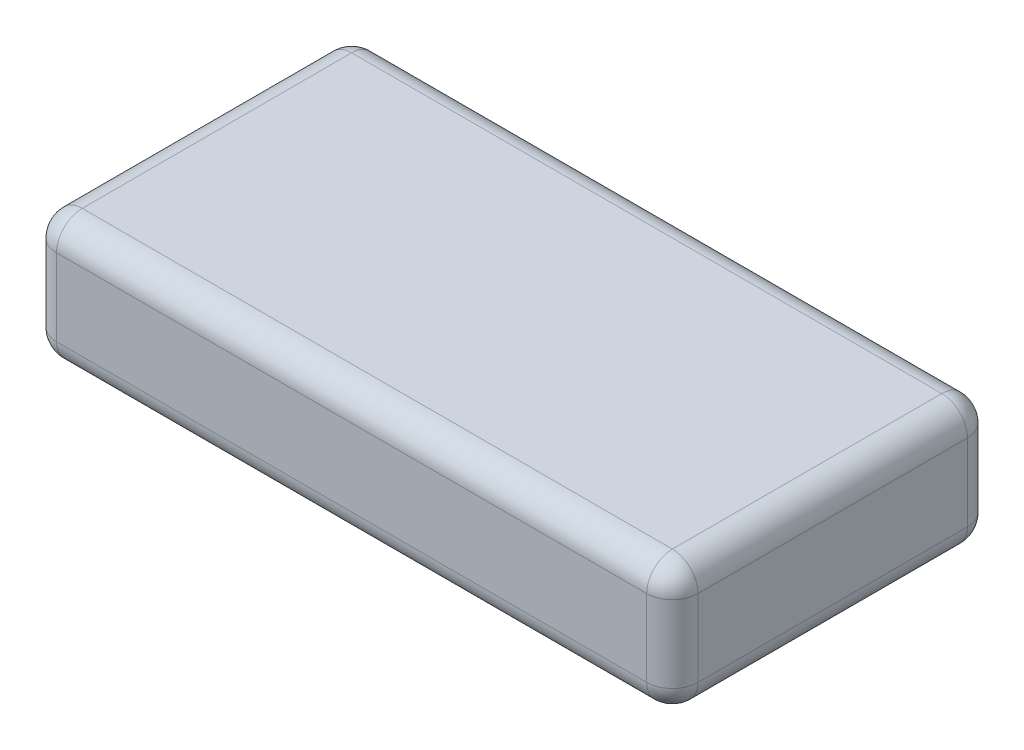
ISO-10303-21;
HEADER;
FILE_DESCRIPTION(('STEP AP214'),'2;1');
FILE_NAME('part.step','',(''),(''),'','','');
FILE_SCHEMA(('AUTOMOTIVE_DESIGN { 1 0 10303 214 1 1 1 1 }'));
ENDSEC;
DATA;
#1=APPLICATION_CONTEXT('core data for automotive mechanical design processes');
#2=APPLICATION_PROTOCOL_DEFINITION('international standard','automotive_design',2000,#1);
#3=PRODUCT_CONTEXT('',#1,'mechanical');
#4=PRODUCT('Part','Part','',(#3));
#5=PRODUCT_RELATED_PRODUCT_CATEGORY('part','',(#4));
#6=PRODUCT_DEFINITION_FORMATION('','',#4);
#7=PRODUCT_DEFINITION_CONTEXT('part definition',#1,'design');
#8=PRODUCT_DEFINITION('design','',#6,#7);
#9=PRODUCT_DEFINITION_SHAPE('','',#8);
#10=(LENGTH_UNIT() NAMED_UNIT(*) SI_UNIT(.MILLI.,.METRE.));
#11=(NAMED_UNIT(*) PLANE_ANGLE_UNIT() SI_UNIT($,.RADIAN.));
#12=(NAMED_UNIT(*) SI_UNIT($,.STERADIAN.) SOLID_ANGLE_UNIT());
#13=UNCERTAINTY_MEASURE_WITH_UNIT(LENGTH_MEASURE(1.E-05),#10,'distance_accuracy_value','');
#14=(GEOMETRIC_REPRESENTATION_CONTEXT(3) GLOBAL_UNCERTAINTY_ASSIGNED_CONTEXT((#13)) GLOBAL_UNIT_ASSIGNED_CONTEXT((#10,
#11,#12)) REPRESENTATION_CONTEXT('',''));
#15=CARTESIAN_POINT('',(0.,0.,0.));
#16=DIRECTION('',(0.,0.,1.));
#17=DIRECTION('',(1.,0.,0.));
#18=AXIS2_PLACEMENT_3D('',#15,#16,#17);
#19=CARTESIAN_POINT('',(0.,2.,0.));
#20=DIRECTION('',(1.,0.,0.));
#21=DIRECTION('',(0.,0.,-1.));
#22=AXIS2_PLACEMENT_3D('',#19,#20,#21);
#23=PLANE('',#22);
#24=DIRECTION('',(0.,0.,1.));
#25=VECTOR('',#24,1.);
#26=CARTESIAN_POINT('',(0.,1.6,0.));
#27=LINE('',#26,#25);
#28=CARTESIAN_POINT('',(0.,1.6,4.6));
#29=VERTEX_POINT('',#28);
#30=CARTESIAN_POINT('',(0.,1.6,0.4));
#31=VERTEX_POINT('',#30);
#32=EDGE_CURVE('E159',#29,#31,#27,.F.);
#33=ORIENTED_EDGE('',*,*,#32,.T.);
#34=DIRECTION('',(0.,-1.,0.));
#35=VECTOR('',#34,1.);
#36=CARTESIAN_POINT('',(0.,2.,0.4));
#37=LINE('',#36,#35);
#38=CARTESIAN_POINT('',(0.,0.4,0.4));
#39=VERTEX_POINT('',#38);
#40=EDGE_CURVE('E132',#31,#39,#37,.T.);
#41=ORIENTED_EDGE('',*,*,#40,.T.);
#42=DIRECTION('',(0.,0.,1.));
#43=VECTOR('',#42,1.);
#44=CARTESIAN_POINT('',(0.,0.4,0.));
#45=LINE('',#44,#43);
#46=CARTESIAN_POINT('',(0.,0.4,4.6));
#47=VERTEX_POINT('',#46);
#48=EDGE_CURVE('E150',#39,#47,#45,.T.);
#49=ORIENTED_EDGE('',*,*,#48,.T.);
#50=DIRECTION('',(0.,-1.,0.));
#51=VECTOR('',#50,1.);
#52=CARTESIAN_POINT('',(0.,2.,4.6));
#53=LINE('',#52,#51);
#54=EDGE_CURVE('E156',#47,#29,#53,.F.);
#55=ORIENTED_EDGE('',*,*,#54,.T.);
#56=EDGE_LOOP('',(#33,#41,#49,#55));
#57=FACE_BOUND('',#56,.T.);
#58=ADVANCED_FACE('F38',(#57),#23,.F.);
#59=CARTESIAN_POINT('',(0.,2.,5.));
#60=DIRECTION('',(0.,0.,-1.));
#61=DIRECTION('',(-1.,0.,0.));
#62=AXIS2_PLACEMENT_3D('',#59,#60,#61);
#63=PLANE('',#62);
#64=DIRECTION('',(0.,-1.,0.));
#65=VECTOR('',#64,1.);
#66=CARTESIAN_POINT('',(0.400000000000001,2.,5.));
#67=LINE('',#66,#65);
#68=CARTESIAN_POINT('',(0.400000000000001,1.6,5.));
#69=VERTEX_POINT('',#68);
#70=CARTESIAN_POINT('',(0.400000000000001,0.4,5.));
#71=VERTEX_POINT('',#70);
#72=EDGE_CURVE('E185',#69,#71,#67,.T.);
#73=ORIENTED_EDGE('',*,*,#72,.T.);
#74=DIRECTION('',(1.,0.,0.));
#75=VECTOR('',#74,1.);
#76=CARTESIAN_POINT('',(0.,0.4,5.));
#77=LINE('',#76,#75);
#78=CARTESIAN_POINT('',(9.6,0.4,5.));
#79=VERTEX_POINT('',#78);
#80=EDGE_CURVE('E188',#71,#79,#77,.T.);
#81=ORIENTED_EDGE('',*,*,#80,.T.);
#82=DIRECTION('',(0.,-1.,0.));
#83=VECTOR('',#82,1.);
#84=CARTESIAN_POINT('',(9.6,2.,5.));
#85=LINE('',#84,#83);
#86=CARTESIAN_POINT('',(9.6,1.6,5.));
#87=VERTEX_POINT('',#86);
#88=EDGE_CURVE('E183',#79,#87,#85,.F.);
#89=ORIENTED_EDGE('',*,*,#88,.T.);
#90=DIRECTION('',(1.,0.,0.));
#91=VECTOR('',#90,1.);
#92=CARTESIAN_POINT('',(0.,1.6,5.));
#93=LINE('',#92,#91);
#94=EDGE_CURVE('E181',#87,#69,#93,.F.);
#95=ORIENTED_EDGE('',*,*,#94,.T.);
#96=EDGE_LOOP('',(#73,#81,#89,#95));
#97=FACE_BOUND('',#96,.T.);
#98=ADVANCED_FACE('F285',(#97),#63,.F.);
#99=CARTESIAN_POINT('',(9.99999999999999,2.,0.));
#100=DIRECTION('',(-1.,0.,0.));
#101=DIRECTION('',(0.,0.,1.));
#102=AXIS2_PLACEMENT_3D('',#99,#100,#101);
#103=PLANE('',#102);
#104=DIRECTION('',(0.,-1.,0.));
#105=VECTOR('',#104,1.);
#106=CARTESIAN_POINT('',(10.,2.,4.6));
#107=LINE('',#106,#105);
#108=CARTESIAN_POINT('',(10.,1.6,4.6));
#109=VERTEX_POINT('',#108);
#110=CARTESIAN_POINT('',(10.,0.4,4.6));
#111=VERTEX_POINT('',#110);
#112=EDGE_CURVE('E47',#109,#111,#107,.T.);
#113=ORIENTED_EDGE('',*,*,#112,.T.);
#114=DIRECTION('',(0.,0.,-1.));
#115=VECTOR('',#114,1.);
#116=CARTESIAN_POINT('',(9.99999999999999,0.4,0.));
#117=LINE('',#116,#115);
#118=CARTESIAN_POINT('',(9.99999999999999,0.4,0.4));
#119=VERTEX_POINT('',#118);
#120=EDGE_CURVE('E11',#111,#119,#117,.T.);
#121=ORIENTED_EDGE('',*,*,#120,.T.);
#122=DIRECTION('',(0.,-1.,0.));
#123=VECTOR('',#122,1.);
#124=CARTESIAN_POINT('',(9.99999999999999,2.,0.4));
#125=LINE('',#124,#123);
#126=CARTESIAN_POINT('',(9.99999999999999,1.6,0.4));
#127=VERTEX_POINT('',#126);
#128=EDGE_CURVE('E201',#119,#127,#125,.F.);
#129=ORIENTED_EDGE('',*,*,#128,.T.);
#130=DIRECTION('',(0.,0.,-1.));
#131=VECTOR('',#130,1.);
#132=CARTESIAN_POINT('',(10.,1.6,5.));
#133=LINE('',#132,#131);
#134=EDGE_CURVE('E199',#127,#109,#133,.F.);
#135=ORIENTED_EDGE('',*,*,#134,.T.);
#136=EDGE_LOOP('',(#113,#121,#129,#135));
#137=FACE_BOUND('',#136,.T.);
#138=ADVANCED_FACE('F297',(#137),#103,.F.);
#139=CARTESIAN_POINT('',(0.,2.,0.));
#140=DIRECTION('',(0.,0.,1.));
#141=DIRECTION('',(1.,0.,0.));
#142=AXIS2_PLACEMENT_3D('',#139,#140,#141);
#143=PLANE('',#142);
#144=DIRECTION('',(0.,-1.,0.));
#145=VECTOR('',#144,1.);
#146=CARTESIAN_POINT('',(9.6,2.,0.));
#147=LINE('',#146,#145);
#148=CARTESIAN_POINT('',(9.6,1.6,0.));
#149=VERTEX_POINT('',#148);
#150=CARTESIAN_POINT('',(9.6,0.4,0.));
#151=VERTEX_POINT('',#150);
#152=EDGE_CURVE('E163',#149,#151,#147,.T.);
#153=ORIENTED_EDGE('',*,*,#152,.T.);
#154=DIRECTION('',(-1.,0.,0.));
#155=VECTOR('',#154,1.);
#156=CARTESIAN_POINT('',(0.,0.4,0.));
#157=LINE('',#156,#155);
#158=CARTESIAN_POINT('',(0.4,0.4,0.));
#159=VERTEX_POINT('',#158);
#160=EDGE_CURVE('E170',#151,#159,#157,.T.);
#161=ORIENTED_EDGE('',*,*,#160,.T.);
#162=DIRECTION('',(0.,-1.,0.));
#163=VECTOR('',#162,1.);
#164=CARTESIAN_POINT('',(0.4,2.,0.));
#165=LINE('',#164,#163);
#166=CARTESIAN_POINT('',(0.4,1.6,0.));
#167=VERTEX_POINT('',#166);
#168=EDGE_CURVE('E134',#159,#167,#165,.F.);
#169=ORIENTED_EDGE('',*,*,#168,.T.);
#170=DIRECTION('',(-1.,0.,0.));
#171=VECTOR('',#170,1.);
#172=CARTESIAN_POINT('',(9.99999999999999,1.6,0.));
#173=LINE('',#172,#171);
#174=EDGE_CURVE('E161',#167,#149,#173,.F.);
#175=ORIENTED_EDGE('',*,*,#174,.T.);
#176=EDGE_LOOP('',(#153,#161,#169,#175));
#177=FACE_BOUND('',#176,.T.);
#178=ADVANCED_FACE('F311',(#177),#143,.F.);
#179=CARTESIAN_POINT('',(0.,2.,0.));
#180=DIRECTION('',(0.,1.,0.));
#181=DIRECTION('',(0.,0.,1.));
#182=AXIS2_PLACEMENT_3D('',#179,#180,#181);
#183=PLANE('',#182);
#184=DIRECTION('',(0.,0.,-1.));
#185=VECTOR('',#184,1.);
#186=CARTESIAN_POINT('',(9.6,2.,0.));
#187=LINE('',#186,#185);
#188=CARTESIAN_POINT('',(9.6,2.,4.6));
#189=VERTEX_POINT('',#188);
#190=CARTESIAN_POINT('',(9.6,2.,0.4));
#191=VERTEX_POINT('',#190);
#192=EDGE_CURVE('E174',#189,#191,#187,.T.);
#193=ORIENTED_EDGE('',*,*,#192,.T.);
#194=DIRECTION('',(-1.,0.,0.));
#195=VECTOR('',#194,1.);
#196=CARTESIAN_POINT('',(0.,2.,0.4));
#197=LINE('',#196,#195);
#198=CARTESIAN_POINT('',(0.4,2.,0.4));
#199=VERTEX_POINT('',#198);
#200=EDGE_CURVE('E179',#191,#199,#197,.T.);
#201=ORIENTED_EDGE('',*,*,#200,.T.);
#202=DIRECTION('',(0.,0.,1.));
#203=VECTOR('',#202,1.);
#204=CARTESIAN_POINT('',(0.400000000000001,2.,5.));
#205=LINE('',#204,#203);
#206=CARTESIAN_POINT('',(0.400000000000001,2.,4.6));
#207=VERTEX_POINT('',#206);
#208=EDGE_CURVE('E176',#199,#207,#205,.T.);
#209=ORIENTED_EDGE('',*,*,#208,.T.);
#210=DIRECTION('',(1.,0.,0.));
#211=VECTOR('',#210,1.);
#212=CARTESIAN_POINT('',(10.,2.,4.6));
#213=LINE('',#212,#211);
#214=EDGE_CURVE('E172',#207,#189,#213,.T.);
#215=ORIENTED_EDGE('',*,*,#214,.T.);
#216=EDGE_LOOP('',(#193,#201,#209,#215));
#217=FACE_BOUND('',#216,.T.);
#218=ADVANCED_FACE('F276',(#217),#183,.T.);
#219=CARTESIAN_POINT('',(0.,0.,0.));
#220=DIRECTION('',(0.,1.,0.));
#221=DIRECTION('',(0.,0.,1.));
#222=AXIS2_PLACEMENT_3D('',#219,#220,#221);
#223=PLANE('',#222);
#224=DIRECTION('',(1.,0.,0.));
#225=VECTOR('',#224,1.);
#226=CARTESIAN_POINT('',(0.,0.,4.6));
#227=LINE('',#226,#225);
#228=CARTESIAN_POINT('',(9.6,0.,4.6));
#229=VERTEX_POINT('',#228);
#230=CARTESIAN_POINT('',(0.400000000000001,0.,4.6));
#231=VERTEX_POINT('',#230);
#232=EDGE_CURVE('E192',#229,#231,#227,.F.);
#233=ORIENTED_EDGE('',*,*,#232,.T.);
#234=DIRECTION('',(0.,0.,1.));
#235=VECTOR('',#234,1.);
#236=CARTESIAN_POINT('',(0.4,0.,0.));
#237=LINE('',#236,#235);
#238=CARTESIAN_POINT('',(0.4,0.,0.4));
#239=VERTEX_POINT('',#238);
#240=EDGE_CURVE('E196',#231,#239,#237,.F.);
#241=ORIENTED_EDGE('',*,*,#240,.T.);
#242=DIRECTION('',(-1.,0.,0.));
#243=VECTOR('',#242,1.);
#244=CARTESIAN_POINT('',(0.,0.,0.4));
#245=LINE('',#244,#243);
#246=CARTESIAN_POINT('',(9.6,0.,0.4));
#247=VERTEX_POINT('',#246);
#248=EDGE_CURVE('E194',#239,#247,#245,.F.);
#249=ORIENTED_EDGE('',*,*,#248,.T.);
#250=DIRECTION('',(0.,0.,-1.));
#251=VECTOR('',#250,1.);
#252=CARTESIAN_POINT('',(9.6,0.,0.));
#253=LINE('',#252,#251);
#254=EDGE_CURVE('E190',#247,#229,#253,.F.);
#255=ORIENTED_EDGE('',*,*,#254,.T.);
#256=EDGE_LOOP('',(#233,#241,#249,#255));
#257=FACE_BOUND('',#256,.T.);
#258=ADVANCED_FACE('F482',(#257),#223,.F.);
#259=CARTESIAN_POINT('',(9.6,2.,4.6));
#260=DIRECTION('',(0.,-1.,0.));
#261=DIRECTION('',(0.,0.,-1.));
#262=AXIS2_PLACEMENT_3D('',#259,#260,#261);
#263=CYLINDRICAL_SURFACE('',#262,0.4);
#264=CARTESIAN_POINT('',(9.6,1.6,4.6));
#265=DIRECTION('',(0.,1.,0.));
#266=DIRECTION('',(0.,0.,1.));
#267=AXIS2_PLACEMENT_3D('',#264,#265,#266);
#268=CIRCLE('',#267,0.4);
#269=EDGE_CURVE('E42',#87,#109,#268,.T.);
#270=ORIENTED_EDGE('',*,*,#269,.F.);
#271=ORIENTED_EDGE('',*,*,#88,.F.);
#272=CARTESIAN_POINT('',(9.6,0.4,4.6));
#273=DIRECTION('',(0.,-1.,0.));
#274=DIRECTION('',(0.,0.,-1.));
#275=AXIS2_PLACEMENT_3D('',#272,#273,#274);
#276=CIRCLE('',#275,0.4);
#277=EDGE_CURVE('E253',#111,#79,#276,.T.);
#278=ORIENTED_EDGE('',*,*,#277,.F.);
#279=ORIENTED_EDGE('',*,*,#112,.F.);
#280=EDGE_LOOP('',(#270,#271,#278,#279));
#281=FACE_BOUND('',#280,.T.);
#282=ADVANCED_FACE('F40',(#281),#263,.T.);
#283=CARTESIAN_POINT('',(9.6,1.6,4.6));
#284=DIRECTION('',(0.,0.,1.));
#285=DIRECTION('',(1.,0.,0.));
#286=AXIS2_PLACEMENT_3D('',#283,#284,#285);
#287=SPHERICAL_SURFACE('',#286,0.4);
#288=CARTESIAN_POINT('',(9.6,1.6,4.6));
#289=DIRECTION('',(1.,0.,0.));
#290=DIRECTION('',(0.,0.,-1.));
#291=AXIS2_PLACEMENT_3D('',#288,#289,#290);
#292=CIRCLE('',#291,0.4);
#293=EDGE_CURVE('E248',#87,#189,#292,.F.);
#294=ORIENTED_EDGE('',*,*,#293,.F.);
#295=ORIENTED_EDGE('',*,*,#269,.T.);
#296=CARTESIAN_POINT('',(9.6,1.6,4.6));
#297=DIRECTION('',(0.,0.,1.));
#298=DIRECTION('',(1.,0.,0.));
#299=AXIS2_PLACEMENT_3D('',#296,#297,#298);
#300=CIRCLE('',#299,0.4);
#301=EDGE_CURVE('E251',#189,#109,#300,.F.);
#302=ORIENTED_EDGE('',*,*,#301,.F.);
#303=EDGE_LOOP('',(#294,#295,#302));
#304=FACE_BOUND('',#303,.T.);
#305=ADVANCED_FACE('F263',(#304),#287,.T.);
#306=CARTESIAN_POINT('',(9.6,0.4,4.6));
#307=DIRECTION('',(0.,0.,1.));
#308=DIRECTION('',(1.,0.,0.));
#309=AXIS2_PLACEMENT_3D('',#306,#307,#308);
#310=SPHERICAL_SURFACE('',#309,0.4);
#311=CARTESIAN_POINT('',(9.6,0.4,4.6));
#312=DIRECTION('',(0.,0.,1.));
#313=DIRECTION('',(1.,0.,0.));
#314=AXIS2_PLACEMENT_3D('',#311,#312,#313);
#315=CIRCLE('',#314,0.4);
#316=EDGE_CURVE('E243',#111,#229,#315,.F.);
#317=ORIENTED_EDGE('',*,*,#316,.F.);
#318=ORIENTED_EDGE('',*,*,#277,.T.);
#319=CARTESIAN_POINT('',(9.6,0.4,4.6));
#320=DIRECTION('',(1.,0.,0.));
#321=DIRECTION('',(0.,0.,-1.));
#322=AXIS2_PLACEMENT_3D('',#319,#320,#321);
#323=CIRCLE('',#322,0.4);
#324=EDGE_CURVE('E245',#229,#79,#323,.F.);
#325=ORIENTED_EDGE('',*,*,#324,.F.);
#326=EDGE_LOOP('',(#317,#318,#325));
#327=FACE_BOUND('',#326,.T.);
#328=ADVANCED_FACE('F461',(#327),#310,.T.);
#329=CARTESIAN_POINT('',(9.6,1.6,0.));
#330=DIRECTION('',(0.,0.,1.));
#331=DIRECTION('',(1.,0.,0.));
#332=AXIS2_PLACEMENT_3D('',#329,#330,#331);
#333=CYLINDRICAL_SURFACE('',#332,0.4);
#334=ORIENTED_EDGE('',*,*,#301,.T.);
#335=ORIENTED_EDGE('',*,*,#134,.F.);
#336=CARTESIAN_POINT('',(9.6,1.6,0.4));
#337=DIRECTION('',(0.,0.,-1.));
#338=DIRECTION('',(-1.,0.,0.));
#339=AXIS2_PLACEMENT_3D('',#336,#337,#338);
#340=CIRCLE('',#339,0.4);
#341=EDGE_CURVE('E237',#191,#127,#340,.T.);
#342=ORIENTED_EDGE('',*,*,#341,.F.);
#343=ORIENTED_EDGE('',*,*,#192,.F.);
#344=EDGE_LOOP('',(#334,#335,#342,#343));
#345=FACE_BOUND('',#344,.T.);
#346=ADVANCED_FACE('F271',(#345),#333,.T.);
#347=CARTESIAN_POINT('',(0.,1.6,4.6));
#348=DIRECTION('',(-1.,0.,0.));
#349=DIRECTION('',(0.,0.,1.));
#350=AXIS2_PLACEMENT_3D('',#347,#348,#349);
#351=CYLINDRICAL_SURFACE('',#350,0.4);
#352=ORIENTED_EDGE('',*,*,#293,.T.);
#353=ORIENTED_EDGE('',*,*,#214,.F.);
#354=CARTESIAN_POINT('',(0.400000000000001,1.6,4.6));
#355=DIRECTION('',(-1.,0.,0.));
#356=DIRECTION('',(0.,0.,1.));
#357=AXIS2_PLACEMENT_3D('',#354,#355,#356);
#358=CIRCLE('',#357,0.4);
#359=EDGE_CURVE('E234',#69,#207,#358,.T.);
#360=ORIENTED_EDGE('',*,*,#359,.F.);
#361=ORIENTED_EDGE('',*,*,#94,.F.);
#362=EDGE_LOOP('',(#352,#353,#360,#361));
#363=FACE_BOUND('',#362,.T.);
#364=ADVANCED_FACE('F282',(#363),#351,.T.);
#365=CARTESIAN_POINT('',(0.400000000000001,2.,4.6));
#366=DIRECTION('',(0.,-1.,0.));
#367=DIRECTION('',(0.,0.,-1.));
#368=AXIS2_PLACEMENT_3D('',#365,#366,#367);
#369=CYLINDRICAL_SURFACE('',#368,0.4);
#370=CARTESIAN_POINT('',(0.400000000000001,0.4,4.6));
#371=DIRECTION('',(0.,-1.,0.));
#372=DIRECTION('',(0.,0.,-1.));
#373=AXIS2_PLACEMENT_3D('',#370,#371,#372);
#374=CIRCLE('',#373,0.4);
#375=EDGE_CURVE('E228',#71,#47,#374,.T.);
#376=ORIENTED_EDGE('',*,*,#375,.F.);
#377=ORIENTED_EDGE('',*,*,#72,.F.);
#378=CARTESIAN_POINT('',(0.400000000000001,1.6,4.6));
#379=DIRECTION('',(0.,1.,0.));
#380=DIRECTION('',(0.,0.,1.));
#381=AXIS2_PLACEMENT_3D('',#378,#379,#380);
#382=CIRCLE('',#381,0.4);
#383=EDGE_CURVE('E231',#29,#69,#382,.T.);
#384=ORIENTED_EDGE('',*,*,#383,.F.);
#385=ORIENTED_EDGE('',*,*,#54,.F.);
#386=EDGE_LOOP('',(#376,#377,#384,#385));
#387=FACE_BOUND('',#386,.T.);
#388=ADVANCED_FACE('F289',(#387),#369,.T.);
#389=CARTESIAN_POINT('',(0.,0.4,4.6));
#390=DIRECTION('',(1.,0.,0.));
#391=DIRECTION('',(0.,0.,-1.));
#392=AXIS2_PLACEMENT_3D('',#389,#390,#391);
#393=CYLINDRICAL_SURFACE('',#392,0.4);
#394=ORIENTED_EDGE('',*,*,#324,.T.);
#395=ORIENTED_EDGE('',*,*,#80,.F.);
#396=CARTESIAN_POINT('',(0.400000000000001,0.4,4.6));
#397=DIRECTION('',(-1.,0.,0.));
#398=DIRECTION('',(0.,0.,1.));
#399=AXIS2_PLACEMENT_3D('',#396,#397,#398);
#400=CIRCLE('',#399,0.4);
#401=EDGE_CURVE('E226',#231,#71,#400,.T.);
#402=ORIENTED_EDGE('',*,*,#401,.F.);
#403=ORIENTED_EDGE('',*,*,#232,.F.);
#404=EDGE_LOOP('',(#394,#395,#402,#403));
#405=FACE_BOUND('',#404,.T.);
#406=ADVANCED_FACE('F295',(#405),#393,.T.);
#407=CARTESIAN_POINT('',(9.6,0.4,0.));
#408=DIRECTION('',(0.,0.,-1.));
#409=DIRECTION('',(-1.,0.,0.));
#410=AXIS2_PLACEMENT_3D('',#407,#408,#409);
#411=CYLINDRICAL_SURFACE('',#410,0.4);
#412=ORIENTED_EDGE('',*,*,#316,.T.);
#413=ORIENTED_EDGE('',*,*,#254,.F.);
#414=CARTESIAN_POINT('',(9.6,0.4,0.4));
#415=DIRECTION('',(0.,0.,-1.));
#416=DIRECTION('',(-1.,0.,0.));
#417=AXIS2_PLACEMENT_3D('',#414,#415,#416);
#418=CIRCLE('',#417,0.4);
#419=EDGE_CURVE('E223',#119,#247,#418,.T.);
#420=ORIENTED_EDGE('',*,*,#419,.F.);
#421=ORIENTED_EDGE('',*,*,#120,.F.);
#422=EDGE_LOOP('',(#412,#413,#420,#421));
#423=FACE_BOUND('',#422,.T.);
#424=ADVANCED_FACE('F304',(#423),#411,.T.);
#425=CARTESIAN_POINT('',(9.6,2.,0.4));
#426=DIRECTION('',(0.,-1.,0.));
#427=DIRECTION('',(0.,0.,-1.));
#428=AXIS2_PLACEMENT_3D('',#425,#426,#427);
#429=CYLINDRICAL_SURFACE('',#428,0.4);
#430=CARTESIAN_POINT('',(9.6,1.6,0.4));
#431=DIRECTION('',(0.,1.,0.));
#432=DIRECTION('',(0.,0.,1.));
#433=AXIS2_PLACEMENT_3D('',#430,#431,#432);
#434=CIRCLE('',#433,0.4);
#435=EDGE_CURVE('E240',#127,#149,#434,.T.);
#436=ORIENTED_EDGE('',*,*,#435,.F.);
#437=ORIENTED_EDGE('',*,*,#128,.F.);
#438=CARTESIAN_POINT('',(9.6,0.4,0.4));
#439=DIRECTION('',(0.,-1.,0.));
#440=DIRECTION('',(0.,0.,-1.));
#441=AXIS2_PLACEMENT_3D('',#438,#439,#440);
#442=CIRCLE('',#441,0.4);
#443=EDGE_CURVE('E220',#151,#119,#442,.T.);
#444=ORIENTED_EDGE('',*,*,#443,.F.);
#445=ORIENTED_EDGE('',*,*,#152,.F.);
#446=EDGE_LOOP('',(#436,#437,#444,#445));
#447=FACE_BOUND('',#446,.T.);
#448=ADVANCED_FACE('F300',(#447),#429,.T.);
#449=CARTESIAN_POINT('',(9.6,1.6,0.4));
#450=DIRECTION('',(0.,0.,1.));
#451=DIRECTION('',(1.,0.,0.));
#452=AXIS2_PLACEMENT_3D('',#449,#450,#451);
#453=SPHERICAL_SURFACE('',#452,0.4);
#454=ORIENTED_EDGE('',*,*,#341,.T.);
#455=ORIENTED_EDGE('',*,*,#435,.T.);
#456=CARTESIAN_POINT('',(9.6,1.6,0.4));
#457=DIRECTION('',(1.,0.,0.));
#458=DIRECTION('',(0.,0.,-1.));
#459=AXIS2_PLACEMENT_3D('',#456,#457,#458);
#460=CIRCLE('',#459,0.4);
#461=EDGE_CURVE('E217',#191,#149,#460,.F.);
#462=ORIENTED_EDGE('',*,*,#461,.F.);
#463=EDGE_LOOP('',(#454,#455,#462));
#464=FACE_BOUND('',#463,.T.);
#465=ADVANCED_FACE('F314',(#464),#453,.T.);
#466=CARTESIAN_POINT('',(0.400000000000001,1.6,4.6));
#467=DIRECTION('',(0.,0.,1.));
#468=DIRECTION('',(1.,0.,0.));
#469=AXIS2_PLACEMENT_3D('',#466,#467,#468);
#470=SPHERICAL_SURFACE('',#469,0.4);
#471=ORIENTED_EDGE('',*,*,#383,.T.);
#472=ORIENTED_EDGE('',*,*,#359,.T.);
#473=CARTESIAN_POINT('',(0.400000000000001,1.6,4.6));
#474=DIRECTION('',(0.,0.,1.));
#475=DIRECTION('',(1.,0.,0.));
#476=AXIS2_PLACEMENT_3D('',#473,#474,#475);
#477=CIRCLE('',#476,0.4);
#478=EDGE_CURVE('E215',#29,#207,#477,.F.);
#479=ORIENTED_EDGE('',*,*,#478,.F.);
#480=EDGE_LOOP('',(#471,#472,#479));
#481=FACE_BOUND('',#480,.T.);
#482=ADVANCED_FACE('F324',(#481),#470,.T.);
#483=CARTESIAN_POINT('',(0.400000000000001,0.4,4.6));
#484=DIRECTION('',(0.,0.,1.));
#485=DIRECTION('',(1.,0.,0.));
#486=AXIS2_PLACEMENT_3D('',#483,#484,#485);
#487=SPHERICAL_SURFACE('',#486,0.4);
#488=ORIENTED_EDGE('',*,*,#401,.T.);
#489=ORIENTED_EDGE('',*,*,#375,.T.);
#490=CARTESIAN_POINT('',(0.400000000000001,0.4,4.6));
#491=DIRECTION('',(0.,0.,1.));
#492=DIRECTION('',(1.,0.,0.));
#493=AXIS2_PLACEMENT_3D('',#490,#491,#492);
#494=CIRCLE('',#493,0.4);
#495=EDGE_CURVE('E153',#231,#47,#494,.F.);
#496=ORIENTED_EDGE('',*,*,#495,.F.);
#497=EDGE_LOOP('',(#488,#489,#496));
#498=FACE_BOUND('',#497,.T.);
#499=ADVANCED_FACE('F326',(#498),#487,.T.);
#500=CARTESIAN_POINT('',(9.6,0.4,0.4));
#501=DIRECTION('',(0.,0.,1.));
#502=DIRECTION('',(1.,0.,0.));
#503=AXIS2_PLACEMENT_3D('',#500,#501,#502);
#504=SPHERICAL_SURFACE('',#503,0.4);
#505=ORIENTED_EDGE('',*,*,#443,.T.);
#506=ORIENTED_EDGE('',*,*,#419,.T.);
#507=CARTESIAN_POINT('',(9.6,0.4,0.4));
#508=DIRECTION('',(1.,0.,0.));
#509=DIRECTION('',(0.,0.,-1.));
#510=AXIS2_PLACEMENT_3D('',#507,#508,#509);
#511=CIRCLE('',#510,0.4);
#512=EDGE_CURVE('E211',#151,#247,#511,.F.);
#513=ORIENTED_EDGE('',*,*,#512,.F.);
#514=EDGE_LOOP('',(#505,#506,#513));
#515=FACE_BOUND('',#514,.T.);
#516=ADVANCED_FACE('F306',(#515),#504,.T.);
#517=CARTESIAN_POINT('',(0.,1.6,0.4));
#518=DIRECTION('',(1.,0.,0.));
#519=DIRECTION('',(0.,0.,-1.));
#520=AXIS2_PLACEMENT_3D('',#517,#518,#519);
#521=CYLINDRICAL_SURFACE('',#520,0.4);
#522=ORIENTED_EDGE('',*,*,#461,.T.);
#523=ORIENTED_EDGE('',*,*,#174,.F.);
#524=CARTESIAN_POINT('',(0.4,1.6,0.4));
#525=DIRECTION('',(-1.,0.,0.));
#526=DIRECTION('',(0.,0.,1.));
#527=AXIS2_PLACEMENT_3D('',#524,#525,#526);
#528=CIRCLE('',#527,0.4);
#529=EDGE_CURVE('E208',#199,#167,#528,.T.);
#530=ORIENTED_EDGE('',*,*,#529,.F.);
#531=ORIENTED_EDGE('',*,*,#200,.F.);
#532=EDGE_LOOP('',(#522,#523,#530,#531));
#533=FACE_BOUND('',#532,.T.);
#534=ADVANCED_FACE('F316',(#533),#521,.T.);
#535=CARTESIAN_POINT('',(0.4,1.6,0.));
#536=DIRECTION('',(0.,0.,-1.));
#537=DIRECTION('',(-1.,0.,0.));
#538=AXIS2_PLACEMENT_3D('',#535,#536,#537);
#539=CYLINDRICAL_SURFACE('',#538,0.4);
#540=ORIENTED_EDGE('',*,*,#478,.T.);
#541=ORIENTED_EDGE('',*,*,#208,.F.);
#542=CARTESIAN_POINT('',(0.4,1.6,0.4));
#543=DIRECTION('',(0.,0.,-1.));
#544=DIRECTION('',(-1.,0.,0.));
#545=AXIS2_PLACEMENT_3D('',#542,#543,#544);
#546=CIRCLE('',#545,0.4);
#547=EDGE_CURVE('E147',#31,#199,#546,.T.);
#548=ORIENTED_EDGE('',*,*,#547,.F.);
#549=ORIENTED_EDGE('',*,*,#32,.F.);
#550=EDGE_LOOP('',(#540,#541,#548,#549));
#551=FACE_BOUND('',#550,.T.);
#552=ADVANCED_FACE('F322',(#551),#539,.T.);
#553=CARTESIAN_POINT('',(0.4,0.4,0.));
#554=DIRECTION('',(0.,0.,1.));
#555=DIRECTION('',(1.,0.,0.));
#556=AXIS2_PLACEMENT_3D('',#553,#554,#555);
#557=CYLINDRICAL_SURFACE('',#556,0.4);
#558=ORIENTED_EDGE('',*,*,#495,.T.);
#559=ORIENTED_EDGE('',*,*,#48,.F.);
#560=CARTESIAN_POINT('',(0.4,0.4,0.4));
#561=DIRECTION('',(0.,0.,-1.));
#562=DIRECTION('',(-1.,0.,0.));
#563=AXIS2_PLACEMENT_3D('',#560,#561,#562);
#564=CIRCLE('',#563,0.4);
#565=EDGE_CURVE('E139',#239,#39,#564,.T.);
#566=ORIENTED_EDGE('',*,*,#565,.F.);
#567=ORIENTED_EDGE('',*,*,#240,.F.);
#568=EDGE_LOOP('',(#558,#559,#566,#567));
#569=FACE_BOUND('',#568,.T.);
#570=ADVANCED_FACE('F151',(#569),#557,.T.);
#571=CARTESIAN_POINT('',(0.,0.4,0.4));
#572=DIRECTION('',(-1.,0.,0.));
#573=DIRECTION('',(0.,0.,1.));
#574=AXIS2_PLACEMENT_3D('',#571,#572,#573);
#575=CYLINDRICAL_SURFACE('',#574,0.4);
#576=ORIENTED_EDGE('',*,*,#512,.T.);
#577=ORIENTED_EDGE('',*,*,#248,.F.);
#578=CARTESIAN_POINT('',(0.4,0.4,0.4));
#579=DIRECTION('',(-1.,0.,0.));
#580=DIRECTION('',(0.,0.,1.));
#581=AXIS2_PLACEMENT_3D('',#578,#579,#580);
#582=CIRCLE('',#581,0.4);
#583=EDGE_CURVE('E143',#159,#239,#582,.T.);
#584=ORIENTED_EDGE('',*,*,#583,.F.);
#585=ORIENTED_EDGE('',*,*,#160,.F.);
#586=EDGE_LOOP('',(#576,#577,#584,#585));
#587=FACE_BOUND('',#586,.T.);
#588=ADVANCED_FACE('F309',(#587),#575,.T.);
#589=CARTESIAN_POINT('',(0.4,1.6,0.4));
#590=DIRECTION('',(0.,0.,1.));
#591=DIRECTION('',(1.,0.,0.));
#592=AXIS2_PLACEMENT_3D('',#589,#590,#591);
#593=SPHERICAL_SURFACE('',#592,0.4);
#594=ORIENTED_EDGE('',*,*,#547,.T.);
#595=ORIENTED_EDGE('',*,*,#529,.T.);
#596=CARTESIAN_POINT('',(0.4,1.6,0.4));
#597=DIRECTION('',(0.,1.,0.));
#598=DIRECTION('',(0.,0.,1.));
#599=AXIS2_PLACEMENT_3D('',#596,#597,#598);
#600=CIRCLE('',#599,0.4);
#601=EDGE_CURVE('E136',#31,#167,#600,.F.);
#602=ORIENTED_EDGE('',*,*,#601,.F.);
#603=EDGE_LOOP('',(#594,#595,#602));
#604=FACE_BOUND('',#603,.T.);
#605=ADVANCED_FACE('F320',(#604),#593,.T.);
#606=CARTESIAN_POINT('',(0.4,0.4,0.4));
#607=DIRECTION('',(0.,0.,1.));
#608=DIRECTION('',(1.,0.,0.));
#609=AXIS2_PLACEMENT_3D('',#606,#607,#608);
#610=SPHERICAL_SURFACE('',#609,0.4);
#611=ORIENTED_EDGE('',*,*,#583,.T.);
#612=ORIENTED_EDGE('',*,*,#565,.T.);
#613=CARTESIAN_POINT('',(0.4,0.4,0.4));
#614=DIRECTION('',(0.,-1.,0.));
#615=DIRECTION('',(0.,0.,-1.));
#616=AXIS2_PLACEMENT_3D('',#613,#614,#615);
#617=CIRCLE('',#616,0.4);
#618=EDGE_CURVE('E128',#159,#39,#617,.F.);
#619=ORIENTED_EDGE('',*,*,#618,.F.);
#620=EDGE_LOOP('',(#611,#612,#619));
#621=FACE_BOUND('',#620,.T.);
#622=ADVANCED_FACE('F141',(#621),#610,.T.);
#623=CARTESIAN_POINT('',(0.4,2.,0.4));
#624=DIRECTION('',(0.,-1.,0.));
#625=DIRECTION('',(0.,0.,-1.));
#626=AXIS2_PLACEMENT_3D('',#623,#624,#625);
#627=CYLINDRICAL_SURFACE('',#626,0.4);
#628=ORIENTED_EDGE('',*,*,#601,.T.);
#629=ORIENTED_EDGE('',*,*,#168,.F.);
#630=ORIENTED_EDGE('',*,*,#618,.T.);
#631=ORIENTED_EDGE('',*,*,#40,.F.);
#632=EDGE_LOOP('',(#628,#629,#630,#631));
#633=FACE_BOUND('',#632,.T.);
#634=ADVANCED_FACE('F130',(#633),#627,.T.);
#635=CLOSED_SHELL('',(#58,#98,#138,#178,#218,#258,#282,#305,#328,#346,#364,#388,#406,#424,#448,
#465,#482,#499,#516,#534,#552,#570,#588,#605,#622,#634));
#636=MANIFOLD_SOLID_BREP('B2',#635);
#637=ADVANCED_BREP_SHAPE_REPRESENTATION('',(#18,#636),#14);
#638=SHAPE_DEFINITION_REPRESENTATION(#9,#637);
ENDSEC;
END-ISO-10303-21;
